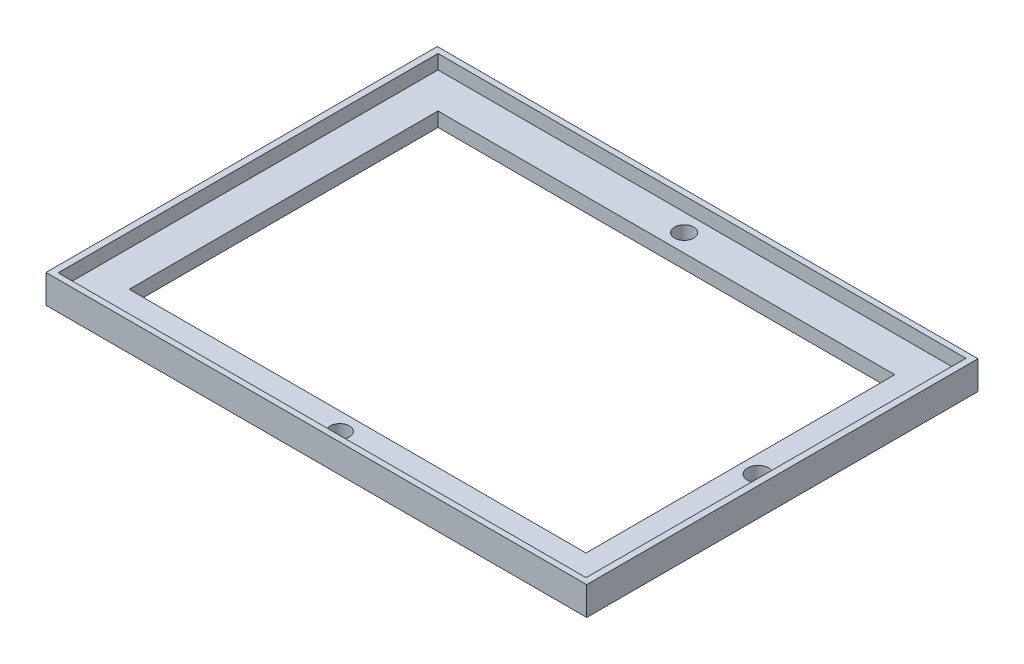
ISO-10303-21;
HEADER;
FILE_DESCRIPTION(('STEP AP214'),'2;1');
FILE_NAME('part.step','',(''),(''),'','','');
FILE_SCHEMA(('AUTOMOTIVE_DESIGN { 1 0 10303 214 1 1 1 1 }'));
ENDSEC;
DATA;
#1=APPLICATION_CONTEXT('core data for automotive mechanical design processes');
#2=APPLICATION_PROTOCOL_DEFINITION('international standard','automotive_design',2000,#1);
#3=PRODUCT_CONTEXT('',#1,'mechanical');
#4=PRODUCT('Part','Part','',(#3));
#5=PRODUCT_RELATED_PRODUCT_CATEGORY('part','',(#4));
#6=PRODUCT_DEFINITION_FORMATION('','',#4);
#7=PRODUCT_DEFINITION_CONTEXT('part definition',#1,'design');
#8=PRODUCT_DEFINITION('design','',#6,#7);
#9=PRODUCT_DEFINITION_SHAPE('','',#8);
#10=(LENGTH_UNIT() NAMED_UNIT(*) SI_UNIT(.MILLI.,.METRE.));
#11=(NAMED_UNIT(*) PLANE_ANGLE_UNIT() SI_UNIT($,.RADIAN.));
#12=(NAMED_UNIT(*) SI_UNIT($,.STERADIAN.) SOLID_ANGLE_UNIT());
#13=UNCERTAINTY_MEASURE_WITH_UNIT(LENGTH_MEASURE(1.E-05),#10,'distance_accuracy_value','');
#14=(GEOMETRIC_REPRESENTATION_CONTEXT(3) GLOBAL_UNCERTAINTY_ASSIGNED_CONTEXT((#13)) GLOBAL_UNIT_ASSIGNED_CONTEXT((#10,
#11,#12)) REPRESENTATION_CONTEXT('',''));
#15=CARTESIAN_POINT('',(0.,0.,0.));
#16=DIRECTION('',(0.,0.,1.));
#17=DIRECTION('',(1.,0.,0.));
#18=AXIS2_PLACEMENT_3D('',#15,#16,#17);
#19=CARTESIAN_POINT('',(32.1,4.,-21.7));
#20=DIRECTION('',(-1.,0.,0.));
#21=DIRECTION('',(0.,0.,1.));
#22=AXIS2_PLACEMENT_3D('',#19,#20,#21);
#23=PLANE('',#22);
#24=DIRECTION('',(0.,-1.,0.));
#25=VECTOR('',#24,1.);
#26=CARTESIAN_POINT('',(32.1,4.,21.7));
#27=LINE('',#26,#25);
#28=CARTESIAN_POINT('',(32.1,2.,21.7));
#29=VERTEX_POINT('',#28);
#30=CARTESIAN_POINT('',(32.1,0.,21.7));
#31=VERTEX_POINT('',#30);
#32=EDGE_CURVE('E207',#29,#31,#27,.T.);
#33=ORIENTED_EDGE('',*,*,#32,.F.);
#34=DIRECTION('',(0.,0.,-1.));
#35=VECTOR('',#34,1.);
#36=CARTESIAN_POINT('',(32.1,2.,-21.7));
#37=LINE('',#36,#35);
#38=CARTESIAN_POINT('',(32.1,2.,-21.7));
#39=VERTEX_POINT('',#38);
#40=EDGE_CURVE('E62',#29,#39,#37,.T.);
#41=ORIENTED_EDGE('',*,*,#40,.T.);
#42=DIRECTION('',(0.,-1.,0.));
#43=VECTOR('',#42,1.);
#44=CARTESIAN_POINT('',(32.1,4.,-21.7));
#45=LINE('',#44,#43);
#46=CARTESIAN_POINT('',(32.1,0.,-21.7));
#47=VERTEX_POINT('',#46);
#48=EDGE_CURVE('E216',#39,#47,#45,.T.);
#49=ORIENTED_EDGE('',*,*,#48,.T.);
#50=DIRECTION('',(0.,0.,-1.));
#51=VECTOR('',#50,1.);
#52=CARTESIAN_POINT('',(32.1,0.,-21.7));
#53=LINE('',#52,#51);
#54=EDGE_CURVE('E191',#31,#47,#53,.T.);
#55=ORIENTED_EDGE('',*,*,#54,.F.);
#56=EDGE_LOOP('',(#33,#41,#49,#55));
#57=FACE_BOUND('',#56,.T.);
#58=ADVANCED_FACE('F38',(#57),#23,.T.);
#59=CARTESIAN_POINT('',(-32.1,4.,-21.7));
#60=DIRECTION('',(0.,0.,1.));
#61=DIRECTION('',(1.,0.,0.));
#62=AXIS2_PLACEMENT_3D('',#59,#60,#61);
#63=PLANE('',#62);
#64=ORIENTED_EDGE('',*,*,#48,.F.);
#65=DIRECTION('',(-1.,0.,0.));
#66=VECTOR('',#65,1.);
#67=CARTESIAN_POINT('',(-32.1,2.,-21.7));
#68=LINE('',#67,#66);
#69=CARTESIAN_POINT('',(-32.1,2.,-21.7));
#70=VERTEX_POINT('',#69);
#71=EDGE_CURVE('E185',#39,#70,#68,.T.);
#72=ORIENTED_EDGE('',*,*,#71,.T.);
#73=DIRECTION('',(0.,-1.,0.));
#74=VECTOR('',#73,1.);
#75=CARTESIAN_POINT('',(-32.1,4.,-21.7));
#76=LINE('',#75,#74);
#77=CARTESIAN_POINT('',(-32.1,0.,-21.7));
#78=VERTEX_POINT('',#77);
#79=EDGE_CURVE('E213',#70,#78,#76,.T.);
#80=ORIENTED_EDGE('',*,*,#79,.T.);
#81=DIRECTION('',(-1.,0.,0.));
#82=VECTOR('',#81,1.);
#83=CARTESIAN_POINT('',(-32.1,0.,-21.7));
#84=LINE('',#83,#82);
#85=EDGE_CURVE('E195',#47,#78,#84,.T.);
#86=ORIENTED_EDGE('',*,*,#85,.F.);
#87=EDGE_LOOP('',(#64,#72,#80,#86));
#88=FACE_BOUND('',#87,.T.);
#89=ADVANCED_FACE('F296',(#88),#63,.T.);
#90=CARTESIAN_POINT('',(-32.1,4.,-21.7));
#91=DIRECTION('',(1.,0.,0.));
#92=DIRECTION('',(0.,0.,-1.));
#93=AXIS2_PLACEMENT_3D('',#90,#91,#92);
#94=PLANE('',#93);
#95=ORIENTED_EDGE('',*,*,#79,.F.);
#96=DIRECTION('',(0.,0.,1.));
#97=VECTOR('',#96,1.);
#98=CARTESIAN_POINT('',(-32.1,2.,-21.7));
#99=LINE('',#98,#97);
#100=CARTESIAN_POINT('',(-32.1,2.,21.7));
#101=VERTEX_POINT('',#100);
#102=EDGE_CURVE('E176',#70,#101,#99,.T.);
#103=ORIENTED_EDGE('',*,*,#102,.T.);
#104=DIRECTION('',(0.,-1.,0.));
#105=VECTOR('',#104,1.);
#106=CARTESIAN_POINT('',(-32.1,4.,21.7));
#107=LINE('',#106,#105);
#108=CARTESIAN_POINT('',(-32.1,0.,21.7));
#109=VERTEX_POINT('',#108);
#110=EDGE_CURVE('E210',#101,#109,#107,.T.);
#111=ORIENTED_EDGE('',*,*,#110,.T.);
#112=DIRECTION('',(0.,0.,1.));
#113=VECTOR('',#112,1.);
#114=CARTESIAN_POINT('',(-32.1,0.,-21.7));
#115=LINE('',#114,#113);
#116=EDGE_CURVE('E199',#78,#109,#115,.T.);
#117=ORIENTED_EDGE('',*,*,#116,.F.);
#118=EDGE_LOOP('',(#95,#103,#111,#117));
#119=FACE_BOUND('',#118,.T.);
#120=ADVANCED_FACE('F291',(#119),#94,.T.);
#121=CARTESIAN_POINT('',(-32.1,4.,21.7));
#122=DIRECTION('',(0.,0.,-1.));
#123=DIRECTION('',(-1.,0.,0.));
#124=AXIS2_PLACEMENT_3D('',#121,#122,#123);
#125=PLANE('',#124);
#126=ORIENTED_EDGE('',*,*,#110,.F.);
#127=DIRECTION('',(1.,0.,0.));
#128=VECTOR('',#127,1.);
#129=CARTESIAN_POINT('',(-32.1,2.,21.7));
#130=LINE('',#129,#128);
#131=EDGE_CURVE('E11',#101,#29,#130,.T.);
#132=ORIENTED_EDGE('',*,*,#131,.T.);
#133=ORIENTED_EDGE('',*,*,#32,.T.);
#134=DIRECTION('',(1.,0.,0.));
#135=VECTOR('',#134,1.);
#136=CARTESIAN_POINT('',(-32.1,0.,21.7));
#137=LINE('',#136,#135);
#138=EDGE_CURVE('E203',#109,#31,#137,.T.);
#139=ORIENTED_EDGE('',*,*,#138,.F.);
#140=EDGE_LOOP('',(#126,#132,#133,#139));
#141=FACE_BOUND('',#140,.T.);
#142=ADVANCED_FACE('F281',(#141),#125,.T.);
#143=CARTESIAN_POINT('',(0.,4.,0.));
#144=DIRECTION('',(0.,1.,0.));
#145=DIRECTION('',(0.,0.,1.));
#146=AXIS2_PLACEMENT_3D('',#143,#144,#145);
#147=PLANE('',#146);
#148=DIRECTION('',(0.,0.,-1.));
#149=VECTOR('',#148,1.);
#150=CARTESIAN_POINT('',(37.1,4.,-26.7));
#151=LINE('',#150,#149);
#152=CARTESIAN_POINT('',(37.1,4.,26.7));
#153=VERTEX_POINT('',#152);
#154=CARTESIAN_POINT('',(37.1,4.,-26.7));
#155=VERTEX_POINT('',#154);
#156=EDGE_CURVE('E54',#153,#155,#151,.T.);
#157=ORIENTED_EDGE('',*,*,#156,.F.);
#158=DIRECTION('',(1.,0.,0.));
#159=VECTOR('',#158,1.);
#160=CARTESIAN_POINT('',(-37.1,4.,26.7));
#161=LINE('',#160,#159);
#162=CARTESIAN_POINT('',(-37.1,4.,26.7));
#163=VERTEX_POINT('',#162);
#164=EDGE_CURVE('E150',#163,#153,#161,.T.);
#165=ORIENTED_EDGE('',*,*,#164,.F.);
#166=DIRECTION('',(0.,0.,1.));
#167=VECTOR('',#166,1.);
#168=CARTESIAN_POINT('',(-37.1,4.,-26.7));
#169=LINE('',#168,#167);
#170=CARTESIAN_POINT('',(-37.1,4.,-26.7));
#171=VERTEX_POINT('',#170);
#172=EDGE_CURVE('E154',#171,#163,#169,.T.);
#173=ORIENTED_EDGE('',*,*,#172,.F.);
#174=DIRECTION('',(-1.,0.,0.));
#175=VECTOR('',#174,1.);
#176=CARTESIAN_POINT('',(-37.1,4.,-26.7));
#177=LINE('',#176,#175);
#178=EDGE_CURVE('E166',#155,#171,#177,.T.);
#179=ORIENTED_EDGE('',*,*,#178,.F.);
#180=EDGE_LOOP('',(#157,#165,#173,#179));
#181=FACE_BOUND('',#180,.T.);
#182=DIRECTION('',(0.,0.,-1.));
#183=VECTOR('',#182,1.);
#184=CARTESIAN_POINT('',(38.,4.,-27.5));
#185=LINE('',#184,#183);
#186=CARTESIAN_POINT('',(38.,4.,27.5));
#187=VERTEX_POINT('',#186);
#188=CARTESIAN_POINT('',(38.,4.,-27.5));
#189=VERTEX_POINT('',#188);
#190=EDGE_CURVE('E220',#187,#189,#185,.T.);
#191=ORIENTED_EDGE('',*,*,#190,.T.);
#192=DIRECTION('',(-1.,0.,0.));
#193=VECTOR('',#192,1.);
#194=CARTESIAN_POINT('',(-38.,4.,-27.5));
#195=LINE('',#194,#193);
#196=CARTESIAN_POINT('',(-38.,4.,-27.5));
#197=VERTEX_POINT('',#196);
#198=EDGE_CURVE('E224',#189,#197,#195,.T.);
#199=ORIENTED_EDGE('',*,*,#198,.T.);
#200=DIRECTION('',(0.,0.,1.));
#201=VECTOR('',#200,1.);
#202=CARTESIAN_POINT('',(-38.,4.,-27.5));
#203=LINE('',#202,#201);
#204=CARTESIAN_POINT('',(-38.,4.,27.5));
#205=VERTEX_POINT('',#204);
#206=EDGE_CURVE('E228',#197,#205,#203,.T.);
#207=ORIENTED_EDGE('',*,*,#206,.T.);
#208=DIRECTION('',(1.,0.,0.));
#209=VECTOR('',#208,1.);
#210=CARTESIAN_POINT('',(-38.,4.,27.5));
#211=LINE('',#210,#209);
#212=EDGE_CURVE('E231',#205,#187,#211,.T.);
#213=ORIENTED_EDGE('',*,*,#212,.T.);
#214=EDGE_LOOP('',(#191,#199,#207,#213));
#215=FACE_BOUND('',#214,.T.);
#216=ADVANCED_FACE('F279',(#181,#215),#147,.T.);
#217=CARTESIAN_POINT('',(0.,0.,0.));
#218=DIRECTION('',(0.,1.,0.));
#219=DIRECTION('',(0.,0.,1.));
#220=AXIS2_PLACEMENT_3D('',#217,#218,#219);
#221=PLANE('',#220);
#222=CARTESIAN_POINT('',(34.6,0.,0.));
#223=DIRECTION('',(0.,1.,0.));
#224=DIRECTION('',(0.,0.,1.));
#225=AXIS2_PLACEMENT_3D('',#222,#223,#224);
#226=CIRCLE('',#225,1.5);
#227=CARTESIAN_POINT('',(34.6,0.,1.5));
#228=VERTEX_POINT('',#227);
#229=EDGE_CURVE('E342',#228,#228,#226,.F.);
#230=ORIENTED_EDGE('',*,*,#229,.F.);
#231=EDGE_LOOP('',(#230));
#232=FACE_BOUND('',#231,.T.);
#233=CARTESIAN_POINT('',(0.,0.,-24.2));
#234=DIRECTION('',(0.,1.,0.));
#235=DIRECTION('',(0.,0.,1.));
#236=AXIS2_PLACEMENT_3D('',#233,#234,#235);
#237=CIRCLE('',#236,1.35);
#238=CARTESIAN_POINT('',(0.,0.,-22.85));
#239=VERTEX_POINT('',#238);
#240=EDGE_CURVE('E167',#239,#239,#237,.T.);
#241=ORIENTED_EDGE('',*,*,#240,.T.);
#242=EDGE_LOOP('',(#241));
#243=FACE_BOUND('',#242,.T.);
#244=CARTESIAN_POINT('',(0.,0.,24.2));
#245=DIRECTION('',(0.,1.,0.));
#246=DIRECTION('',(0.,0.,-1.));
#247=AXIS2_PLACEMENT_3D('',#244,#245,#246);
#248=CIRCLE('',#247,1.35);
#249=CARTESIAN_POINT('',(0.,0.,22.85));
#250=VERTEX_POINT('',#249);
#251=EDGE_CURVE('E348',#250,#250,#248,.T.);
#252=ORIENTED_EDGE('',*,*,#251,.T.);
#253=EDGE_LOOP('',(#252));
#254=FACE_BOUND('',#253,.T.);
#255=DIRECTION('',(0.,0.,-1.));
#256=VECTOR('',#255,1.);
#257=CARTESIAN_POINT('',(38.,0.,-27.5));
#258=LINE('',#257,#256);
#259=CARTESIAN_POINT('',(38.,0.,27.5));
#260=VERTEX_POINT('',#259);
#261=CARTESIAN_POINT('',(38.,0.,-27.5));
#262=VERTEX_POINT('',#261);
#263=EDGE_CURVE('E219',#260,#262,#258,.T.);
#264=ORIENTED_EDGE('',*,*,#263,.F.);
#265=DIRECTION('',(1.,0.,0.));
#266=VECTOR('',#265,1.);
#267=CARTESIAN_POINT('',(-38.,0.,27.5));
#268=LINE('',#267,#266);
#269=CARTESIAN_POINT('',(-38.,0.,27.5));
#270=VERTEX_POINT('',#269);
#271=EDGE_CURVE('E225',#270,#260,#268,.T.);
#272=ORIENTED_EDGE('',*,*,#271,.F.);
#273=DIRECTION('',(0.,0.,1.));
#274=VECTOR('',#273,1.);
#275=CARTESIAN_POINT('',(-38.,0.,-27.5));
#276=LINE('',#275,#274);
#277=CARTESIAN_POINT('',(-38.,0.,-27.5));
#278=VERTEX_POINT('',#277);
#279=EDGE_CURVE('E241',#278,#270,#276,.T.);
#280=ORIENTED_EDGE('',*,*,#279,.F.);
#281=DIRECTION('',(-1.,0.,0.));
#282=VECTOR('',#281,1.);
#283=CARTESIAN_POINT('',(-38.,0.,-27.5));
#284=LINE('',#283,#282);
#285=EDGE_CURVE('E238',#262,#278,#284,.T.);
#286=ORIENTED_EDGE('',*,*,#285,.F.);
#287=EDGE_LOOP('',(#264,#272,#280,#286));
#288=FACE_BOUND('',#287,.T.);
#289=ORIENTED_EDGE('',*,*,#54,.T.);
#290=ORIENTED_EDGE('',*,*,#85,.T.);
#291=ORIENTED_EDGE('',*,*,#116,.T.);
#292=ORIENTED_EDGE('',*,*,#138,.T.);
#293=EDGE_LOOP('',(#289,#290,#291,#292));
#294=FACE_BOUND('',#293,.T.);
#295=ADVANCED_FACE('F268',(#232,#243,#254,#288,#294),#221,.F.);
#296=CARTESIAN_POINT('',(38.,4.,-27.5));
#297=DIRECTION('',(-1.,0.,0.));
#298=DIRECTION('',(0.,0.,1.));
#299=AXIS2_PLACEMENT_3D('',#296,#297,#298);
#300=PLANE('',#299);
#301=ORIENTED_EDGE('',*,*,#263,.T.);
#302=DIRECTION('',(0.,-1.,0.));
#303=VECTOR('',#302,1.);
#304=CARTESIAN_POINT('',(38.,4.,-27.5));
#305=LINE('',#304,#303);
#306=EDGE_CURVE('E47',#189,#262,#305,.T.);
#307=ORIENTED_EDGE('',*,*,#306,.F.);
#308=ORIENTED_EDGE('',*,*,#190,.F.);
#309=DIRECTION('',(0.,-1.,0.));
#310=VECTOR('',#309,1.);
#311=CARTESIAN_POINT('',(38.,4.,27.5));
#312=LINE('',#311,#310);
#313=EDGE_CURVE('E234',#187,#260,#312,.T.);
#314=ORIENTED_EDGE('',*,*,#313,.T.);
#315=EDGE_LOOP('',(#301,#307,#308,#314));
#316=FACE_BOUND('',#315,.T.);
#317=ADVANCED_FACE('F40',(#316),#300,.F.);
#318=CARTESIAN_POINT('',(-38.,4.,-27.5));
#319=DIRECTION('',(0.,0.,1.));
#320=DIRECTION('',(1.,0.,0.));
#321=AXIS2_PLACEMENT_3D('',#318,#319,#320);
#322=PLANE('',#321);
#323=ORIENTED_EDGE('',*,*,#285,.T.);
#324=DIRECTION('',(0.,-1.,0.));
#325=VECTOR('',#324,1.);
#326=CARTESIAN_POINT('',(-38.,4.,-27.5));
#327=LINE('',#326,#325);
#328=EDGE_CURVE('E253',#197,#278,#327,.T.);
#329=ORIENTED_EDGE('',*,*,#328,.F.);
#330=ORIENTED_EDGE('',*,*,#198,.F.);
#331=ORIENTED_EDGE('',*,*,#306,.T.);
#332=EDGE_LOOP('',(#323,#329,#330,#331));
#333=FACE_BOUND('',#332,.T.);
#334=ADVANCED_FACE('F260',(#333),#322,.F.);
#335=CARTESIAN_POINT('',(-38.,4.,-27.5));
#336=DIRECTION('',(1.,0.,0.));
#337=DIRECTION('',(0.,0.,-1.));
#338=AXIS2_PLACEMENT_3D('',#335,#336,#337);
#339=PLANE('',#338);
#340=ORIENTED_EDGE('',*,*,#279,.T.);
#341=DIRECTION('',(0.,-1.,0.));
#342=VECTOR('',#341,1.);
#343=CARTESIAN_POINT('',(-38.,4.,27.5));
#344=LINE('',#343,#342);
#345=EDGE_CURVE('E249',#205,#270,#344,.T.);
#346=ORIENTED_EDGE('',*,*,#345,.F.);
#347=ORIENTED_EDGE('',*,*,#206,.F.);
#348=ORIENTED_EDGE('',*,*,#328,.T.);
#349=EDGE_LOOP('',(#340,#346,#347,#348));
#350=FACE_BOUND('',#349,.T.);
#351=ADVANCED_FACE('F273',(#350),#339,.F.);
#352=CARTESIAN_POINT('',(-38.,4.,27.5));
#353=DIRECTION('',(0.,0.,-1.));
#354=DIRECTION('',(-1.,0.,0.));
#355=AXIS2_PLACEMENT_3D('',#352,#353,#354);
#356=PLANE('',#355);
#357=ORIENTED_EDGE('',*,*,#271,.T.);
#358=ORIENTED_EDGE('',*,*,#313,.F.);
#359=ORIENTED_EDGE('',*,*,#212,.F.);
#360=ORIENTED_EDGE('',*,*,#345,.T.);
#361=EDGE_LOOP('',(#357,#358,#359,#360));
#362=FACE_BOUND('',#361,.T.);
#363=ADVANCED_FACE('F277',(#362),#356,.F.);
#364=CARTESIAN_POINT('',(37.1,2.,-26.7));
#365=DIRECTION('',(1.,0.,0.));
#366=DIRECTION('',(0.,0.,-1.));
#367=AXIS2_PLACEMENT_3D('',#364,#365,#366);
#368=PLANE('',#367);
#369=ORIENTED_EDGE('',*,*,#156,.T.);
#370=DIRECTION('',(0.,1.,0.));
#371=VECTOR('',#370,1.);
#372=CARTESIAN_POINT('',(37.1,2.,-26.7));
#373=LINE('',#372,#371);
#374=CARTESIAN_POINT('',(37.1,2.,-26.7));
#375=VERTEX_POINT('',#374);
#376=EDGE_CURVE('E125',#375,#155,#373,.T.);
#377=ORIENTED_EDGE('',*,*,#376,.F.);
#378=DIRECTION('',(0.,0.,-1.));
#379=VECTOR('',#378,1.);
#380=CARTESIAN_POINT('',(37.1,2.,-26.7));
#381=LINE('',#380,#379);
#382=CARTESIAN_POINT('',(37.1,2.,26.7));
#383=VERTEX_POINT('',#382);
#384=EDGE_CURVE('E129',#383,#375,#381,.T.);
#385=ORIENTED_EDGE('',*,*,#384,.F.);
#386=DIRECTION('',(0.,1.,0.));
#387=VECTOR('',#386,1.);
#388=CARTESIAN_POINT('',(37.1,2.,26.7));
#389=LINE('',#388,#387);
#390=EDGE_CURVE('E173',#383,#153,#389,.T.);
#391=ORIENTED_EDGE('',*,*,#390,.T.);
#392=EDGE_LOOP('',(#369,#377,#385,#391));
#393=FACE_BOUND('',#392,.T.);
#394=ADVANCED_FACE('F127',(#393),#368,.F.);
#395=CARTESIAN_POINT('',(-37.1,2.,26.7));
#396=DIRECTION('',(0.,0.,1.));
#397=DIRECTION('',(1.,0.,0.));
#398=AXIS2_PLACEMENT_3D('',#395,#396,#397);
#399=PLANE('',#398);
#400=ORIENTED_EDGE('',*,*,#164,.T.);
#401=ORIENTED_EDGE('',*,*,#390,.F.);
#402=DIRECTION('',(1.,0.,0.));
#403=VECTOR('',#402,1.);
#404=CARTESIAN_POINT('',(-37.1,2.,26.7));
#405=LINE('',#404,#403);
#406=CARTESIAN_POINT('',(-37.1,2.,26.7));
#407=VERTEX_POINT('',#406);
#408=EDGE_CURVE('E136',#407,#383,#405,.T.);
#409=ORIENTED_EDGE('',*,*,#408,.F.);
#410=DIRECTION('',(0.,1.,0.));
#411=VECTOR('',#410,1.);
#412=CARTESIAN_POINT('',(-37.1,2.,26.7));
#413=LINE('',#412,#411);
#414=EDGE_CURVE('E177',#407,#163,#413,.T.);
#415=ORIENTED_EDGE('',*,*,#414,.T.);
#416=EDGE_LOOP('',(#400,#401,#409,#415));
#417=FACE_BOUND('',#416,.T.);
#418=ADVANCED_FACE('F310',(#417),#399,.F.);
#419=CARTESIAN_POINT('',(-37.1,2.,-26.7));
#420=DIRECTION('',(-1.,0.,0.));
#421=DIRECTION('',(0.,0.,1.));
#422=AXIS2_PLACEMENT_3D('',#419,#420,#421);
#423=PLANE('',#422);
#424=ORIENTED_EDGE('',*,*,#172,.T.);
#425=ORIENTED_EDGE('',*,*,#414,.F.);
#426=DIRECTION('',(0.,0.,1.));
#427=VECTOR('',#426,1.);
#428=CARTESIAN_POINT('',(-37.1,2.,-26.7));
#429=LINE('',#428,#427);
#430=CARTESIAN_POINT('',(-37.1,2.,-26.7));
#431=VERTEX_POINT('',#430);
#432=EDGE_CURVE('E145',#431,#407,#429,.T.);
#433=ORIENTED_EDGE('',*,*,#432,.F.);
#434=DIRECTION('',(0.,1.,0.));
#435=VECTOR('',#434,1.);
#436=CARTESIAN_POINT('',(-37.1,2.,-26.7));
#437=LINE('',#436,#435);
#438=EDGE_CURVE('E135',#431,#171,#437,.T.);
#439=ORIENTED_EDGE('',*,*,#438,.T.);
#440=EDGE_LOOP('',(#424,#425,#433,#439));
#441=FACE_BOUND('',#440,.T.);
#442=ADVANCED_FACE('F313',(#441),#423,.F.);
#443=CARTESIAN_POINT('',(-37.1,2.,-26.7));
#444=DIRECTION('',(0.,0.,-1.));
#445=DIRECTION('',(-1.,0.,0.));
#446=AXIS2_PLACEMENT_3D('',#443,#444,#445);
#447=PLANE('',#446);
#448=ORIENTED_EDGE('',*,*,#178,.T.);
#449=ORIENTED_EDGE('',*,*,#438,.F.);
#450=DIRECTION('',(-1.,0.,0.));
#451=VECTOR('',#450,1.);
#452=CARTESIAN_POINT('',(-37.1,2.,-26.7));
#453=LINE('',#452,#451);
#454=EDGE_CURVE('E139',#375,#431,#453,.T.);
#455=ORIENTED_EDGE('',*,*,#454,.F.);
#456=ORIENTED_EDGE('',*,*,#376,.T.);
#457=EDGE_LOOP('',(#448,#449,#455,#456));
#458=FACE_BOUND('',#457,.T.);
#459=ADVANCED_FACE('F140',(#458),#447,.F.);
#460=CARTESIAN_POINT('',(0.,2.,0.));
#461=DIRECTION('',(0.,1.,0.));
#462=DIRECTION('',(0.,0.,1.));
#463=AXIS2_PLACEMENT_3D('',#460,#461,#462);
#464=PLANE('',#463);
#465=CARTESIAN_POINT('',(34.6,2.,0.));
#466=DIRECTION('',(0.,1.,0.));
#467=DIRECTION('',(0.,0.,1.));
#468=AXIS2_PLACEMENT_3D('',#465,#466,#467);
#469=CIRCLE('',#468,1.5);
#470=CARTESIAN_POINT('',(34.6,2.,1.5));
#471=VERTEX_POINT('',#470);
#472=EDGE_CURVE('E339',#471,#471,#469,.T.);
#473=ORIENTED_EDGE('',*,*,#472,.F.);
#474=EDGE_LOOP('',(#473));
#475=FACE_BOUND('',#474,.T.);
#476=CARTESIAN_POINT('',(0.,2.,-24.2));
#477=DIRECTION('',(0.,1.,0.));
#478=DIRECTION('',(0.,0.,1.));
#479=AXIS2_PLACEMENT_3D('',#476,#477,#478);
#480=CIRCLE('',#479,1.35);
#481=CARTESIAN_POINT('',(0.,2.,-22.85));
#482=VERTEX_POINT('',#481);
#483=EDGE_CURVE('E354',#482,#482,#480,.T.);
#484=ORIENTED_EDGE('',*,*,#483,.F.);
#485=EDGE_LOOP('',(#484));
#486=FACE_BOUND('',#485,.T.);
#487=CARTESIAN_POINT('',(0.,2.,24.2));
#488=DIRECTION('',(0.,1.,0.));
#489=DIRECTION('',(0.,0.,-1.));
#490=AXIS2_PLACEMENT_3D('',#487,#488,#489);
#491=CIRCLE('',#490,1.35);
#492=CARTESIAN_POINT('',(0.,2.,22.85));
#493=VERTEX_POINT('',#492);
#494=EDGE_CURVE('E157',#493,#493,#491,.T.);
#495=ORIENTED_EDGE('',*,*,#494,.F.);
#496=EDGE_LOOP('',(#495));
#497=FACE_BOUND('',#496,.T.);
#498=ORIENTED_EDGE('',*,*,#131,.F.);
#499=ORIENTED_EDGE('',*,*,#102,.F.);
#500=ORIENTED_EDGE('',*,*,#71,.F.);
#501=ORIENTED_EDGE('',*,*,#40,.F.);
#502=EDGE_LOOP('',(#498,#499,#500,#501));
#503=FACE_BOUND('',#502,.T.);
#504=ORIENTED_EDGE('',*,*,#384,.T.);
#505=ORIENTED_EDGE('',*,*,#454,.T.);
#506=ORIENTED_EDGE('',*,*,#432,.T.);
#507=ORIENTED_EDGE('',*,*,#408,.T.);
#508=EDGE_LOOP('',(#504,#505,#506,#507));
#509=FACE_BOUND('',#508,.T.);
#510=ADVANCED_FACE('F147',(#475,#486,#497,#503,#509),#464,.T.);
#511=CARTESIAN_POINT('',(0.,0.,24.2));
#512=DIRECTION('',(0.,1.,0.));
#513=DIRECTION('',(0.,0.,1.));
#514=AXIS2_PLACEMENT_3D('',#511,#512,#513);
#515=CYLINDRICAL_SURFACE('',#514,1.35);
#516=ORIENTED_EDGE('',*,*,#251,.F.);
#517=EDGE_LOOP('',(#516));
#518=FACE_BOUND('',#517,.T.);
#519=ORIENTED_EDGE('',*,*,#494,.T.);
#520=EDGE_LOOP('',(#519));
#521=FACE_BOUND('',#520,.T.);
#522=ADVANCED_FACE('F322',(#518,#521),#515,.F.);
#523=CARTESIAN_POINT('',(0.,0.,-24.2));
#524=DIRECTION('',(0.,1.,0.));
#525=DIRECTION('',(0.,0.,1.));
#526=AXIS2_PLACEMENT_3D('',#523,#524,#525);
#527=CYLINDRICAL_SURFACE('',#526,1.35);
#528=ORIENTED_EDGE('',*,*,#240,.F.);
#529=EDGE_LOOP('',(#528));
#530=FACE_BOUND('',#529,.T.);
#531=ORIENTED_EDGE('',*,*,#483,.T.);
#532=EDGE_LOOP('',(#531));
#533=FACE_BOUND('',#532,.T.);
#534=ADVANCED_FACE('F326',(#530,#533),#527,.F.);
#535=CARTESIAN_POINT('',(34.6,-0.00100000000000013,0.));
#536=DIRECTION('',(0.,1.,0.));
#537=DIRECTION('',(0.,0.,1.));
#538=AXIS2_PLACEMENT_3D('',#535,#536,#537);
#539=CYLINDRICAL_SURFACE('',#538,1.5);
#540=ORIENTED_EDGE('',*,*,#472,.T.);
#541=EDGE_LOOP('',(#540));
#542=FACE_BOUND('',#541,.T.);
#543=ORIENTED_EDGE('',*,*,#229,.T.);
#544=EDGE_LOOP('',(#543));
#545=FACE_BOUND('',#544,.T.);
#546=ADVANCED_FACE('F330',(#542,#545),#539,.F.);
#547=CLOSED_SHELL('',(#58,#89,#120,#142,#216,#295,#317,#334,#351,#363,#394,#418,#442,#459,#510,
#522,#534,#546));
#548=MANIFOLD_SOLID_BREP('B2',#547);
#549=ADVANCED_BREP_SHAPE_REPRESENTATION('',(#18,#548),#14);
#550=SHAPE_DEFINITION_REPRESENTATION(#9,#549);
ENDSEC;
END-ISO-10303-21;
